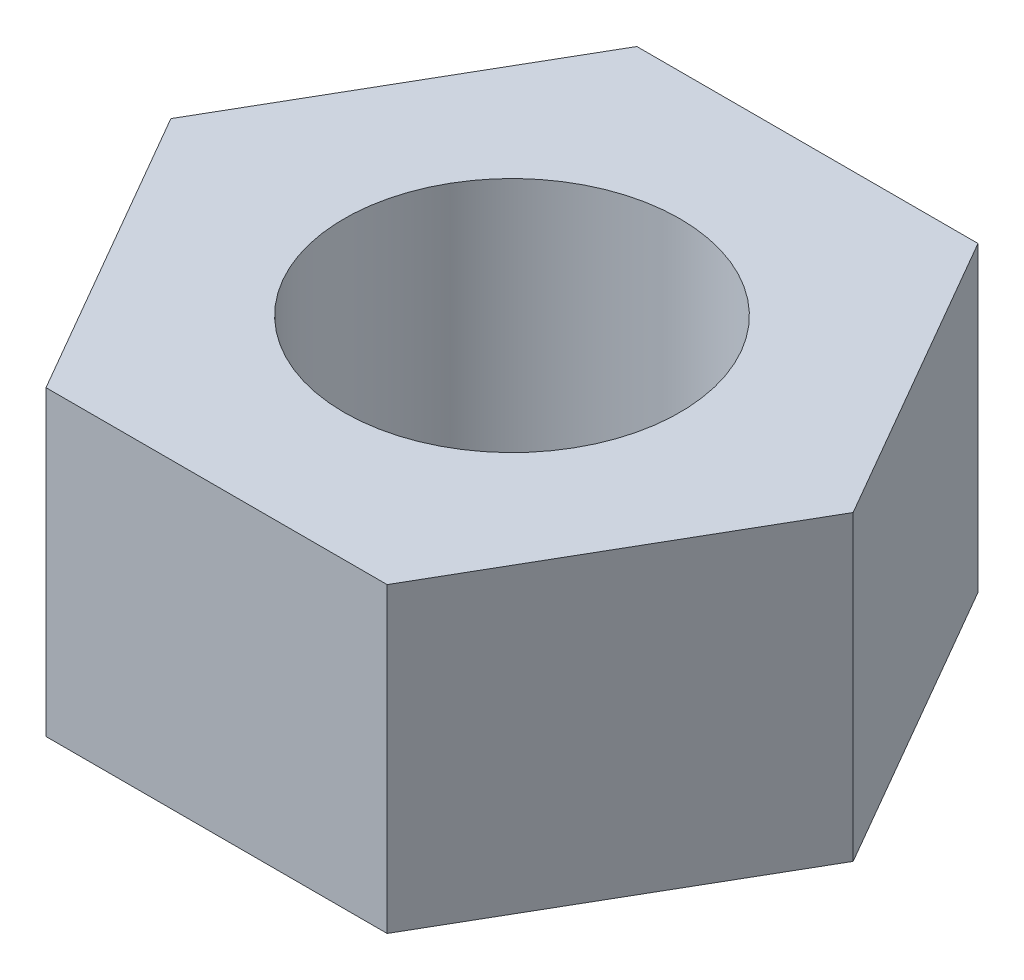
ISO-10303-21;
HEADER;
FILE_DESCRIPTION(('STEP AP214'),'2;1');
FILE_NAME('part.step','',(''),(''),'','','');
FILE_SCHEMA(('AUTOMOTIVE_DESIGN { 1 0 10303 214 1 1 1 1 }'));
ENDSEC;
DATA;
#1=APPLICATION_CONTEXT('core data for automotive mechanical design processes');
#2=APPLICATION_PROTOCOL_DEFINITION('international standard','automotive_design',2000,#1);
#3=PRODUCT_CONTEXT('',#1,'mechanical');
#4=PRODUCT('Part','Part','',(#3));
#5=PRODUCT_RELATED_PRODUCT_CATEGORY('part','',(#4));
#6=PRODUCT_DEFINITION_FORMATION('','',#4);
#7=PRODUCT_DEFINITION_CONTEXT('part definition',#1,'design');
#8=PRODUCT_DEFINITION('design','',#6,#7);
#9=PRODUCT_DEFINITION_SHAPE('','',#8);
#10=(LENGTH_UNIT() NAMED_UNIT(*) SI_UNIT(.MILLI.,.METRE.));
#11=(NAMED_UNIT(*) PLANE_ANGLE_UNIT() SI_UNIT($,.RADIAN.));
#12=(NAMED_UNIT(*) SI_UNIT($,.STERADIAN.) SOLID_ANGLE_UNIT());
#13=UNCERTAINTY_MEASURE_WITH_UNIT(LENGTH_MEASURE(1.E-05),#10,'distance_accuracy_value','');
#14=(GEOMETRIC_REPRESENTATION_CONTEXT(3) GLOBAL_UNCERTAINTY_ASSIGNED_CONTEXT((#13)) GLOBAL_UNIT_ASSIGNED_CONTEXT((#10,
#11,#12)) REPRESENTATION_CONTEXT('',''));
#15=CARTESIAN_POINT('',(0.,0.,0.));
#16=DIRECTION('',(0.,0.,1.));
#17=DIRECTION('',(1.,0.,0.));
#18=AXIS2_PLACEMENT_3D('',#15,#16,#17);
#19=CARTESIAN_POINT('',(0.,4.5,0.));
#20=DIRECTION('',(0.,1.,0.));
#21=DIRECTION('',(0.,0.,1.));
#22=AXIS2_PLACEMENT_3D('',#19,#20,#21);
#23=PLANE('',#22);
#24=DIRECTION('',(1.,0.,0.));
#25=VECTOR('',#24,1.);
#26=CARTESIAN_POINT('',(-2.54034118443435,4.5,4.4));
#27=LINE('',#26,#25);
#28=CARTESIAN_POINT('',(-2.54034118443435,4.5,4.4));
#29=VERTEX_POINT('',#28);
#30=CARTESIAN_POINT('',(2.54034118443435,4.5,4.4));
#31=VERTEX_POINT('',#30);
#32=EDGE_CURVE('E132',#29,#31,#27,.T.);
#33=ORIENTED_EDGE('',*,*,#32,.T.);
#34=DIRECTION('',(0.5,0.,-0.866025403784439));
#35=VECTOR('',#34,1.);
#36=CARTESIAN_POINT('',(2.54034118443435,4.5,4.4));
#37=LINE('',#36,#35);
#38=CARTESIAN_POINT('',(5.08068236886871,4.5,0.));
#39=VERTEX_POINT('',#38);
#40=EDGE_CURVE('E90',#31,#39,#37,.T.);
#41=ORIENTED_EDGE('',*,*,#40,.T.);
#42=DIRECTION('',(-0.5,0.,-0.866025403784439));
#43=VECTOR('',#42,1.);
#44=CARTESIAN_POINT('',(5.08068236886871,4.5,0.));
#45=LINE('',#44,#43);
#46=CARTESIAN_POINT('',(2.54034118443435,4.5,-4.4));
#47=VERTEX_POINT('',#46);
#48=EDGE_CURVE('E103',#39,#47,#45,.T.);
#49=ORIENTED_EDGE('',*,*,#48,.T.);
#50=DIRECTION('',(-1.,0.,0.));
#51=VECTOR('',#50,1.);
#52=CARTESIAN_POINT('',(2.54034118443435,4.5,-4.4));
#53=LINE('',#52,#51);
#54=CARTESIAN_POINT('',(-2.54034118443435,4.5,-4.4));
#55=VERTEX_POINT('',#54);
#56=EDGE_CURVE('E97',#47,#55,#53,.T.);
#57=ORIENTED_EDGE('',*,*,#56,.T.);
#58=DIRECTION('',(-0.5,0.,0.866025403784439));
#59=VECTOR('',#58,1.);
#60=CARTESIAN_POINT('',(-2.54034118443435,4.5,-4.4));
#61=LINE('',#60,#59);
#62=CARTESIAN_POINT('',(-5.0806823688687,4.5,0.));
#63=VERTEX_POINT('',#62);
#64=EDGE_CURVE('E101',#55,#63,#61,.T.);
#65=ORIENTED_EDGE('',*,*,#64,.T.);
#66=DIRECTION('',(0.5,0.,0.866025403784439));
#67=VECTOR('',#66,1.);
#68=CARTESIAN_POINT('',(-5.0806823688687,4.5,0.));
#69=LINE('',#68,#67);
#70=EDGE_CURVE('E53',#63,#29,#69,.T.);
#71=ORIENTED_EDGE('',*,*,#70,.T.);
#72=EDGE_LOOP('',(#33,#41,#49,#57,#65,#71));
#73=FACE_BOUND('',#72,.T.);
#74=CARTESIAN_POINT('',(0.,4.5,0.));
#75=DIRECTION('',(0.,1.,0.));
#76=DIRECTION('',(0.,0.,1.));
#77=AXIS2_PLACEMENT_3D('',#74,#75,#76);
#78=CIRCLE('',#77,2.5);
#79=CARTESIAN_POINT('',(0.,4.5,2.5));
#80=VERTEX_POINT('',#79);
#81=EDGE_CURVE('E125',#80,#80,#78,.T.);
#82=ORIENTED_EDGE('',*,*,#81,.F.);
#83=EDGE_LOOP('',(#82));
#84=FACE_BOUND('',#83,.T.);
#85=ADVANCED_FACE('F36',(#73,#84),#23,.T.);
#86=CARTESIAN_POINT('',(0.,0.,0.));
#87=DIRECTION('',(0.,1.,0.));
#88=DIRECTION('',(0.,0.,1.));
#89=AXIS2_PLACEMENT_3D('',#86,#87,#88);
#90=PLANE('',#89);
#91=DIRECTION('',(1.,0.,0.));
#92=VECTOR('',#91,1.);
#93=CARTESIAN_POINT('',(-2.54034118443435,0.,4.4));
#94=LINE('',#93,#92);
#95=CARTESIAN_POINT('',(-2.54034118443435,0.,4.4));
#96=VERTEX_POINT('',#95);
#97=CARTESIAN_POINT('',(2.54034118443435,0.,4.4));
#98=VERTEX_POINT('',#97);
#99=EDGE_CURVE('E121',#96,#98,#94,.T.);
#100=ORIENTED_EDGE('',*,*,#99,.F.);
#101=DIRECTION('',(0.5,0.,0.866025403784439));
#102=VECTOR('',#101,1.);
#103=CARTESIAN_POINT('',(-5.0806823688687,0.,0.));
#104=LINE('',#103,#102);
#105=CARTESIAN_POINT('',(-5.0806823688687,0.,0.));
#106=VERTEX_POINT('',#105);
#107=EDGE_CURVE('E82',#106,#96,#104,.T.);
#108=ORIENTED_EDGE('',*,*,#107,.F.);
#109=DIRECTION('',(-0.5,0.,0.866025403784439));
#110=VECTOR('',#109,1.);
#111=CARTESIAN_POINT('',(-2.54034118443435,0.,-4.4));
#112=LINE('',#111,#110);
#113=CARTESIAN_POINT('',(-2.54034118443435,0.,-4.4));
#114=VERTEX_POINT('',#113);
#115=EDGE_CURVE('E76',#114,#106,#112,.T.);
#116=ORIENTED_EDGE('',*,*,#115,.F.);
#117=DIRECTION('',(-1.,0.,0.));
#118=VECTOR('',#117,1.);
#119=CARTESIAN_POINT('',(2.54034118443435,0.,-4.4));
#120=LINE('',#119,#118);
#121=CARTESIAN_POINT('',(2.54034118443435,0.,-4.4));
#122=VERTEX_POINT('',#121);
#123=EDGE_CURVE('E111',#122,#114,#120,.T.);
#124=ORIENTED_EDGE('',*,*,#123,.F.);
#125=DIRECTION('',(-0.5,0.,-0.866025403784439));
#126=VECTOR('',#125,1.);
#127=CARTESIAN_POINT('',(5.08068236886871,0.,0.));
#128=LINE('',#127,#126);
#129=CARTESIAN_POINT('',(5.08068236886871,0.,0.));
#130=VERTEX_POINT('',#129);
#131=EDGE_CURVE('E127',#130,#122,#128,.T.);
#132=ORIENTED_EDGE('',*,*,#131,.F.);
#133=DIRECTION('',(0.5,0.,-0.866025403784439));
#134=VECTOR('',#133,1.);
#135=CARTESIAN_POINT('',(2.54034118443435,0.,4.4));
#136=LINE('',#135,#134);
#137=EDGE_CURVE('E124',#98,#130,#136,.T.);
#138=ORIENTED_EDGE('',*,*,#137,.F.);
#139=EDGE_LOOP('',(#100,#108,#116,#124,#132,#138));
#140=FACE_BOUND('',#139,.T.);
#141=CARTESIAN_POINT('',(0.,0.,0.));
#142=DIRECTION('',(0.,1.,0.));
#143=DIRECTION('',(0.,0.,1.));
#144=AXIS2_PLACEMENT_3D('',#141,#142,#143);
#145=CIRCLE('',#144,2.5);
#146=CARTESIAN_POINT('',(0.,0.,2.5));
#147=VERTEX_POINT('',#146);
#148=EDGE_CURVE('E225',#147,#147,#145,.T.);
#149=ORIENTED_EDGE('',*,*,#148,.T.);
#150=EDGE_LOOP('',(#149));
#151=FACE_BOUND('',#150,.T.);
#152=ADVANCED_FACE('F141',(#140,#151),#90,.F.);
#153=CARTESIAN_POINT('',(-2.54034118443435,4.5,4.4));
#154=DIRECTION('',(0.,0.,-1.));
#155=DIRECTION('',(-1.,0.,0.));
#156=AXIS2_PLACEMENT_3D('',#153,#154,#155);
#157=PLANE('',#156);
#158=ORIENTED_EDGE('',*,*,#99,.T.);
#159=DIRECTION('',(0.,-1.,0.));
#160=VECTOR('',#159,1.);
#161=CARTESIAN_POINT('',(2.54034118443435,4.5,4.4));
#162=LINE('',#161,#160);
#163=EDGE_CURVE('E11',#31,#98,#162,.T.);
#164=ORIENTED_EDGE('',*,*,#163,.F.);
#165=ORIENTED_EDGE('',*,*,#32,.F.);
#166=DIRECTION('',(0.,-1.,0.));
#167=VECTOR('',#166,1.);
#168=CARTESIAN_POINT('',(-2.54034118443435,4.5,4.4));
#169=LINE('',#168,#167);
#170=EDGE_CURVE('E117',#29,#96,#169,.T.);
#171=ORIENTED_EDGE('',*,*,#170,.T.);
#172=EDGE_LOOP('',(#158,#164,#165,#171));
#173=FACE_BOUND('',#172,.T.);
#174=ADVANCED_FACE('F38',(#173),#157,.F.);
#175=CARTESIAN_POINT('',(2.54034118443435,4.5,4.4));
#176=DIRECTION('',(-0.866025403784439,0.,-0.5));
#177=DIRECTION('',(-0.5,0.,0.866025403784439));
#178=AXIS2_PLACEMENT_3D('',#175,#176,#177);
#179=PLANE('',#178);
#180=ORIENTED_EDGE('',*,*,#137,.T.);
#181=DIRECTION('',(0.,-1.,0.));
#182=VECTOR('',#181,1.);
#183=CARTESIAN_POINT('',(5.08068236886871,4.5,0.));
#184=LINE('',#183,#182);
#185=EDGE_CURVE('E45',#39,#130,#184,.T.);
#186=ORIENTED_EDGE('',*,*,#185,.F.);
#187=ORIENTED_EDGE('',*,*,#40,.F.);
#188=ORIENTED_EDGE('',*,*,#163,.T.);
#189=EDGE_LOOP('',(#180,#186,#187,#188));
#190=FACE_BOUND('',#189,.T.);
#191=ADVANCED_FACE('F166',(#190),#179,.F.);
#192=CARTESIAN_POINT('',(5.08068236886871,4.5,0.));
#193=DIRECTION('',(-0.866025403784439,0.,0.5));
#194=DIRECTION('',(0.5,0.,0.866025403784439));
#195=AXIS2_PLACEMENT_3D('',#192,#193,#194);
#196=PLANE('',#195);
#197=ORIENTED_EDGE('',*,*,#131,.T.);
#198=DIRECTION('',(0.,-1.,0.));
#199=VECTOR('',#198,1.);
#200=CARTESIAN_POINT('',(2.54034118443435,4.5,-4.4));
#201=LINE('',#200,#199);
#202=EDGE_CURVE('E112',#47,#122,#201,.T.);
#203=ORIENTED_EDGE('',*,*,#202,.F.);
#204=ORIENTED_EDGE('',*,*,#48,.F.);
#205=ORIENTED_EDGE('',*,*,#185,.T.);
#206=EDGE_LOOP('',(#197,#203,#204,#205));
#207=FACE_BOUND('',#206,.T.);
#208=ADVANCED_FACE('F138',(#207),#196,.F.);
#209=CARTESIAN_POINT('',(2.54034118443435,4.5,-4.4));
#210=DIRECTION('',(0.,0.,1.));
#211=DIRECTION('',(1.,0.,0.));
#212=AXIS2_PLACEMENT_3D('',#209,#210,#211);
#213=PLANE('',#212);
#214=ORIENTED_EDGE('',*,*,#123,.T.);
#215=DIRECTION('',(0.,-1.,0.));
#216=VECTOR('',#215,1.);
#217=CARTESIAN_POINT('',(-2.54034118443435,4.5,-4.4));
#218=LINE('',#217,#216);
#219=EDGE_CURVE('E108',#55,#114,#218,.T.);
#220=ORIENTED_EDGE('',*,*,#219,.F.);
#221=ORIENTED_EDGE('',*,*,#56,.F.);
#222=ORIENTED_EDGE('',*,*,#202,.T.);
#223=EDGE_LOOP('',(#214,#220,#221,#222));
#224=FACE_BOUND('',#223,.T.);
#225=ADVANCED_FACE('F109',(#224),#213,.F.);
#226=CARTESIAN_POINT('',(-2.54034118443435,4.5,-4.4));
#227=DIRECTION('',(0.866025403784439,0.,0.5));
#228=DIRECTION('',(0.5,0.,-0.866025403784439));
#229=AXIS2_PLACEMENT_3D('',#226,#227,#228);
#230=PLANE('',#229);
#231=ORIENTED_EDGE('',*,*,#115,.T.);
#232=DIRECTION('',(0.,-1.,0.));
#233=VECTOR('',#232,1.);
#234=CARTESIAN_POINT('',(-5.0806823688687,4.5,0.));
#235=LINE('',#234,#233);
#236=EDGE_CURVE('E113',#63,#106,#235,.T.);
#237=ORIENTED_EDGE('',*,*,#236,.F.);
#238=ORIENTED_EDGE('',*,*,#64,.F.);
#239=ORIENTED_EDGE('',*,*,#219,.T.);
#240=EDGE_LOOP('',(#231,#237,#238,#239));
#241=FACE_BOUND('',#240,.T.);
#242=ADVANCED_FACE('F115',(#241),#230,.F.);
#243=CARTESIAN_POINT('',(-5.0806823688687,4.5,0.));
#244=DIRECTION('',(0.866025403784439,0.,-0.5));
#245=DIRECTION('',(-0.5,0.,-0.866025403784439));
#246=AXIS2_PLACEMENT_3D('',#243,#244,#245);
#247=PLANE('',#246);
#248=ORIENTED_EDGE('',*,*,#107,.T.);
#249=ORIENTED_EDGE('',*,*,#170,.F.);
#250=ORIENTED_EDGE('',*,*,#70,.F.);
#251=ORIENTED_EDGE('',*,*,#236,.T.);
#252=EDGE_LOOP('',(#248,#249,#250,#251));
#253=FACE_BOUND('',#252,.T.);
#254=ADVANCED_FACE('F146',(#253),#247,.F.);
#255=CARTESIAN_POINT('',(0.,4.5,0.));
#256=DIRECTION('',(0.,-1.,0.));
#257=DIRECTION('',(0.,0.,-1.));
#258=AXIS2_PLACEMENT_3D('',#255,#256,#257);
#259=CYLINDRICAL_SURFACE('',#258,2.5);
#260=ORIENTED_EDGE('',*,*,#81,.T.);
#261=EDGE_LOOP('',(#260));
#262=FACE_BOUND('',#261,.T.);
#263=ORIENTED_EDGE('',*,*,#148,.F.);
#264=EDGE_LOOP('',(#263));
#265=FACE_BOUND('',#264,.T.);
#266=ADVANCED_FACE('F148',(#262,#265),#259,.F.);
#267=CLOSED_SHELL('',(#85,#152,#174,#191,#208,#225,#242,#254,#266));
#268=MANIFOLD_SOLID_BREP('B2',#267);
#269=ADVANCED_BREP_SHAPE_REPRESENTATION('',(#18,#268),#14);
#270=SHAPE_DEFINITION_REPRESENTATION(#9,#269);
ENDSEC;
END-ISO-10303-21;
